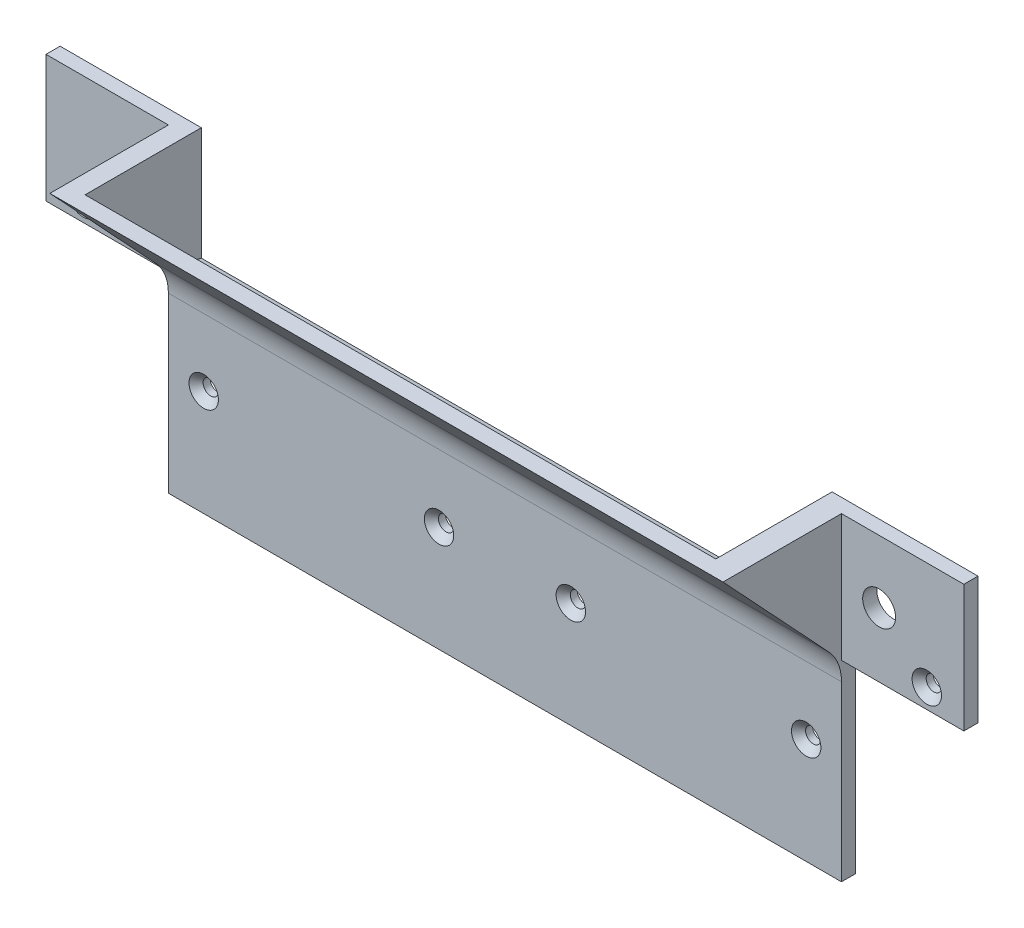
ISO-10303-21;
HEADER;
FILE_DESCRIPTION(('STEP AP214'),'2;1');
FILE_NAME('part.step','',(''),(''),'','','');
FILE_SCHEMA(('AUTOMOTIVE_DESIGN { 1 0 10303 214 1 1 1 1 }'));
ENDSEC;
DATA;
#1=APPLICATION_CONTEXT('core data for automotive mechanical design processes');
#2=APPLICATION_PROTOCOL_DEFINITION('international standard','automotive_design',2000,#1);
#3=PRODUCT_CONTEXT('',#1,'mechanical');
#4=PRODUCT('Part','Part','',(#3));
#5=PRODUCT_RELATED_PRODUCT_CATEGORY('part','',(#4));
#6=PRODUCT_DEFINITION_FORMATION('','',#4);
#7=PRODUCT_DEFINITION_CONTEXT('part definition',#1,'design');
#8=PRODUCT_DEFINITION('design','',#6,#7);
#9=PRODUCT_DEFINITION_SHAPE('','',#8);
#10=(LENGTH_UNIT() NAMED_UNIT(*) SI_UNIT(.MILLI.,.METRE.));
#11=(NAMED_UNIT(*) PLANE_ANGLE_UNIT() SI_UNIT($,.RADIAN.));
#12=(NAMED_UNIT(*) SI_UNIT($,.STERADIAN.) SOLID_ANGLE_UNIT());
#13=UNCERTAINTY_MEASURE_WITH_UNIT(LENGTH_MEASURE(1.E-05),#10,'distance_accuracy_value','');
#14=(GEOMETRIC_REPRESENTATION_CONTEXT(3) GLOBAL_UNCERTAINTY_ASSIGNED_CONTEXT((#13)) GLOBAL_UNIT_ASSIGNED_CONTEXT((#10,
#11,#12)) REPRESENTATION_CONTEXT('',''));
#15=CARTESIAN_POINT('',(0.,0.,0.));
#16=DIRECTION('',(0.,0.,1.));
#17=DIRECTION('',(1.,0.,0.));
#18=AXIS2_PLACEMENT_3D('',#15,#16,#17);
#19=CARTESIAN_POINT('',(0.,0.,3.));
#20=DIRECTION('',(0.,0.,-1.));
#21=DIRECTION('',(-1.,0.,0.));
#22=AXIS2_PLACEMENT_3D('',#19,#20,#21);
#23=PLANE('',#22);
#24=CARTESIAN_POINT('',(-89.62,-21.62,3.));
#25=DIRECTION('',(0.,0.,-1.));
#26=DIRECTION('',(-1.,0.,0.));
#27=AXIS2_PLACEMENT_3D('',#24,#25,#26);
#28=CIRCLE('',#27,3.12500000000002);
#29=CARTESIAN_POINT('',(-92.745,-21.62,3.));
#30=VERTEX_POINT('',#29);
#31=EDGE_CURVE('E253',#30,#30,#28,.T.);
#32=ORIENTED_EDGE('',*,*,#31,.T.);
#33=EDGE_LOOP('',(#32));
#34=FACE_BOUND('',#33,.T.);
#35=DIRECTION('',(0.,-1.,0.));
#36=VECTOR('',#35,1.);
#37=CARTESIAN_POINT('',(-71.5,-25.75,3.));
#38=LINE('',#37,#36);
#39=CARTESIAN_POINT('',(-71.5,1.25000000000001,3.));
#40=VERTEX_POINT('',#39);
#41=CARTESIAN_POINT('',(-71.5,-25.75,3.));
#42=VERTEX_POINT('',#41);
#43=EDGE_CURVE('E377',#40,#42,#38,.T.);
#44=ORIENTED_EDGE('',*,*,#43,.F.);
#45=DIRECTION('',(-1.,0.,0.));
#46=VECTOR('',#45,1.);
#47=CARTESIAN_POINT('',(-66.5,1.25,3.));
#48=LINE('',#47,#46);
#49=CARTESIAN_POINT('',(-97.5,1.24999999999999,3.));
#50=VERTEX_POINT('',#49);
#51=EDGE_CURVE('E366',#40,#50,#48,.T.);
#52=ORIENTED_EDGE('',*,*,#51,.T.);
#53=DIRECTION('',(0.,-1.,0.));
#54=VECTOR('',#53,1.);
#55=CARTESIAN_POINT('',(-97.5,-1.75,3.));
#56=LINE('',#55,#54);
#57=CARTESIAN_POINT('',(-97.5,-25.75,3.));
#58=VERTEX_POINT('',#57);
#59=EDGE_CURVE('E211',#50,#58,#56,.T.);
#60=ORIENTED_EDGE('',*,*,#59,.T.);
#61=DIRECTION('',(1.,0.,0.));
#62=VECTOR('',#61,1.);
#63=CARTESIAN_POINT('',(-97.5,-25.75,3.));
#64=LINE('',#63,#62);
#65=EDGE_CURVE('E208',#58,#42,#64,.T.);
#66=ORIENTED_EDGE('',*,*,#65,.T.);
#67=EDGE_LOOP('',(#44,#52,#60,#66));
#68=FACE_BOUND('',#67,.T.);
#69=CARTESIAN_POINT('',(-79.5,-12.1,3.));
#70=DIRECTION('',(0.,0.,1.));
#71=DIRECTION('',(1.,0.,0.));
#72=AXIS2_PLACEMENT_3D('',#69,#70,#71);
#73=CIRCLE('',#72,3.25000000000001);
#74=CARTESIAN_POINT('',(-76.25,-12.1,3.));
#75=VERTEX_POINT('',#74);
#76=EDGE_CURVE('E482',#75,#75,#73,.T.);
#77=ORIENTED_EDGE('',*,*,#76,.F.);
#78=EDGE_LOOP('',(#77));
#79=FACE_BOUND('',#78,.T.);
#80=ADVANCED_FACE('F40',(#34,#68,#79),#23,.F.);
#81=CARTESIAN_POINT('',(89.62,-21.62,3.));
#82=DIRECTION('',(0.,0.,-1.));
#83=DIRECTION('',(-1.,0.,0.));
#84=AXIS2_PLACEMENT_3D('',#81,#82,#83);
#85=CIRCLE('',#84,3.12500000000002);
#86=CARTESIAN_POINT('',(86.495,-21.62,3.));
#87=VERTEX_POINT('',#86);
#88=EDGE_CURVE('E259',#87,#87,#85,.T.);
#89=ORIENTED_EDGE('',*,*,#88,.T.);
#90=EDGE_LOOP('',(#89));
#91=FACE_BOUND('',#90,.T.);
#92=DIRECTION('',(0.,1.,0.));
#93=VECTOR('',#92,1.);
#94=CARTESIAN_POINT('',(71.5,1.25000000000003,3.));
#95=LINE('',#94,#93);
#96=CARTESIAN_POINT('',(71.4999999999999,-25.75,3.));
#97=VERTEX_POINT('',#96);
#98=CARTESIAN_POINT('',(71.5,1.25000000000002,3.));
#99=VERTEX_POINT('',#98);
#100=EDGE_CURVE('E385',#97,#99,#95,.T.);
#101=ORIENTED_EDGE('',*,*,#100,.F.);
#102=DIRECTION('',(1.,0.,0.));
#103=VECTOR('',#102,1.);
#104=CARTESIAN_POINT('',(97.5,-25.75,3.));
#105=LINE('',#104,#103);
#106=CARTESIAN_POINT('',(97.5,-25.75,3.));
#107=VERTEX_POINT('',#106);
#108=EDGE_CURVE('E216',#97,#107,#105,.T.);
#109=ORIENTED_EDGE('',*,*,#108,.T.);
#110=DIRECTION('',(0.,1.,0.));
#111=VECTOR('',#110,1.);
#112=CARTESIAN_POINT('',(97.5,-1.75,3.));
#113=LINE('',#112,#111);
#114=CARTESIAN_POINT('',(97.5,1.25000000000002,3.));
#115=VERTEX_POINT('',#114);
#116=EDGE_CURVE('E218',#107,#115,#113,.T.);
#117=ORIENTED_EDGE('',*,*,#116,.T.);
#118=DIRECTION('',(-1.,0.,0.));
#119=VECTOR('',#118,1.);
#120=CARTESIAN_POINT('',(66.5,1.25000000000002,3.));
#121=LINE('',#120,#119);
#122=EDGE_CURVE('E398',#115,#99,#121,.T.);
#123=ORIENTED_EDGE('',*,*,#122,.T.);
#124=EDGE_LOOP('',(#101,#109,#117,#123));
#125=FACE_BOUND('',#124,.T.);
#126=CARTESIAN_POINT('',(79.5,-12.1,3.));
#127=DIRECTION('',(0.,0.,1.));
#128=DIRECTION('',(1.,0.,0.));
#129=AXIS2_PLACEMENT_3D('',#126,#127,#128);
#130=CIRCLE('',#129,3.50000000000001);
#131=CARTESIAN_POINT('',(83.,-12.1,3.));
#132=VERTEX_POINT('',#131);
#133=EDGE_CURVE('E483',#132,#132,#130,.T.);
#134=ORIENTED_EDGE('',*,*,#133,.F.);
#135=EDGE_LOOP('',(#134));
#136=FACE_BOUND('',#135,.T.);
#137=ADVANCED_FACE('F302',(#91,#125,#136),#23,.F.);
#138=CARTESIAN_POINT('',(-64.,-44.,3.));
#139=DIRECTION('',(0.,0.,-1.));
#140=DIRECTION('',(-1.,0.,0.));
#141=AXIS2_PLACEMENT_3D('',#138,#139,#140);
#142=CIRCLE('',#141,3.12500000000002);
#143=CARTESIAN_POINT('',(-67.125,-44.,3.));
#144=VERTEX_POINT('',#143);
#145=EDGE_CURVE('E265',#144,#144,#142,.T.);
#146=ORIENTED_EDGE('',*,*,#145,.T.);
#147=EDGE_LOOP('',(#146));
#148=FACE_BOUND('',#147,.T.);
#149=CARTESIAN_POINT('',(-14.,-44.,3.));
#150=DIRECTION('',(0.,0.,-1.));
#151=DIRECTION('',(-1.,0.,0.));
#152=AXIS2_PLACEMENT_3D('',#149,#150,#151);
#153=CIRCLE('',#152,3.12500000000002);
#154=CARTESIAN_POINT('',(-17.125,-44.,3.));
#155=VERTEX_POINT('',#154);
#156=EDGE_CURVE('E268',#155,#155,#153,.T.);
#157=ORIENTED_EDGE('',*,*,#156,.T.);
#158=EDGE_LOOP('',(#157));
#159=FACE_BOUND('',#158,.T.);
#160=CARTESIAN_POINT('',(14.,-44.,3.));
#161=DIRECTION('',(0.,0.,-1.));
#162=DIRECTION('',(-1.,0.,0.));
#163=AXIS2_PLACEMENT_3D('',#160,#161,#162);
#164=CIRCLE('',#163,3.12500000000002);
#165=CARTESIAN_POINT('',(10.875,-44.,3.));
#166=VERTEX_POINT('',#165);
#167=EDGE_CURVE('E271',#166,#166,#164,.T.);
#168=ORIENTED_EDGE('',*,*,#167,.T.);
#169=EDGE_LOOP('',(#168));
#170=FACE_BOUND('',#169,.T.);
#171=CARTESIAN_POINT('',(64.,-44.,3.));
#172=DIRECTION('',(0.,0.,-1.));
#173=DIRECTION('',(-1.,0.,0.));
#174=AXIS2_PLACEMENT_3D('',#171,#172,#173);
#175=CIRCLE('',#174,3.12500000000002);
#176=CARTESIAN_POINT('',(60.875,-44.,3.));
#177=VERTEX_POINT('',#176);
#178=EDGE_CURVE('E274',#177,#177,#175,.T.);
#179=ORIENTED_EDGE('',*,*,#178,.T.);
#180=EDGE_LOOP('',(#179));
#181=FACE_BOUND('',#180,.T.);
#182=DIRECTION('',(0.,1.,0.));
#183=VECTOR('',#182,1.);
#184=CARTESIAN_POINT('',(71.5,-25.75,3.));
#185=LINE('',#184,#183);
#186=CARTESIAN_POINT('',(71.5,-66.5,3.));
#187=VERTEX_POINT('',#186);
#188=CARTESIAN_POINT('',(71.5,-29.6887920426456,3.));
#189=VERTEX_POINT('',#188);
#190=EDGE_CURVE('E62',#187,#189,#185,.T.);
#191=ORIENTED_EDGE('',*,*,#190,.T.);
#192=DIRECTION('',(1.,0.,0.));
#193=VECTOR('',#192,1.);
#194=CARTESIAN_POINT('',(0.,-29.6887920426456,3.));
#195=LINE('',#194,#193);
#196=CARTESIAN_POINT('',(-71.5,-29.6887920426455,3.));
#197=VERTEX_POINT('',#196);
#198=EDGE_CURVE('E181',#189,#197,#195,.F.);
#199=ORIENTED_EDGE('',*,*,#198,.T.);
#200=DIRECTION('',(0.,-1.,0.));
#201=VECTOR('',#200,1.);
#202=CARTESIAN_POINT('',(-71.5,-25.75,3.));
#203=LINE('',#202,#201);
#204=CARTESIAN_POINT('',(-71.5,-66.5,3.));
#205=VERTEX_POINT('',#204);
#206=EDGE_CURVE('E200',#197,#205,#203,.T.);
#207=ORIENTED_EDGE('',*,*,#206,.T.);
#208=DIRECTION('',(1.,0.,0.));
#209=VECTOR('',#208,1.);
#210=CARTESIAN_POINT('',(-71.5,-66.5,3.));
#211=LINE('',#210,#209);
#212=EDGE_CURVE('E207',#205,#187,#211,.T.);
#213=ORIENTED_EDGE('',*,*,#212,.T.);
#214=EDGE_LOOP('',(#191,#199,#207,#213));
#215=FACE_BOUND('',#214,.T.);
#216=ADVANCED_FACE('F199',(#148,#159,#170,#181,#215),#23,.F.);
#217=CARTESIAN_POINT('',(0.,0.,0.));
#218=DIRECTION('',(0.,0.,-1.));
#219=DIRECTION('',(-1.,0.,0.));
#220=AXIS2_PLACEMENT_3D('',#217,#218,#219);
#221=PLANE('',#220);
#222=DIRECTION('',(-1.,0.,0.));
#223=VECTOR('',#222,1.);
#224=CARTESIAN_POINT('',(-66.5,1.25,0.));
#225=LINE('',#224,#223);
#226=CARTESIAN_POINT('',(-67.5,1.25,0.));
#227=VERTEX_POINT('',#226);
#228=CARTESIAN_POINT('',(-97.5,1.24999999999999,0.));
#229=VERTEX_POINT('',#228);
#230=EDGE_CURVE('E394',#227,#229,#225,.T.);
#231=ORIENTED_EDGE('',*,*,#230,.F.);
#232=DIRECTION('',(0.,-1.,0.));
#233=VECTOR('',#232,1.);
#234=CARTESIAN_POINT('',(-67.5,-4.75,0.));
#235=LINE('',#234,#233);
#236=CARTESIAN_POINT('',(-67.5,-22.75,0.));
#237=VERTEX_POINT('',#236);
#238=EDGE_CURVE('E177',#227,#237,#235,.T.);
#239=ORIENTED_EDGE('',*,*,#238,.T.);
#240=DIRECTION('',(-1.,0.,0.));
#241=VECTOR('',#240,1.);
#242=CARTESIAN_POINT('',(66.5,-22.75,0.));
#243=LINE('',#242,#241);
#244=CARTESIAN_POINT('',(66.5,-22.75,0.));
#245=VERTEX_POINT('',#244);
#246=EDGE_CURVE('E350',#245,#237,#243,.T.);
#247=ORIENTED_EDGE('',*,*,#246,.F.);
#248=DIRECTION('',(0.,-1.,0.));
#249=VECTOR('',#248,1.);
#250=CARTESIAN_POINT('',(66.5,-4.75,0.));
#251=LINE('',#250,#249);
#252=CARTESIAN_POINT('',(66.5,1.25000000000002,0.));
#253=VERTEX_POINT('',#252);
#254=EDGE_CURVE('E408',#253,#245,#251,.T.);
#255=ORIENTED_EDGE('',*,*,#254,.F.);
#256=DIRECTION('',(-1.,0.,0.));
#257=VECTOR('',#256,1.);
#258=CARTESIAN_POINT('',(66.5,1.25000000000002,0.));
#259=LINE('',#258,#257);
#260=CARTESIAN_POINT('',(97.5,1.25000000000002,0.));
#261=VERTEX_POINT('',#260);
#262=EDGE_CURVE('E402',#261,#253,#259,.T.);
#263=ORIENTED_EDGE('',*,*,#262,.F.);
#264=DIRECTION('',(0.,1.,0.));
#265=VECTOR('',#264,1.);
#266=CARTESIAN_POINT('',(97.5,-1.75,0.));
#267=LINE('',#266,#265);
#268=CARTESIAN_POINT('',(97.5,-25.75,0.));
#269=VERTEX_POINT('',#268);
#270=EDGE_CURVE('E234',#269,#261,#267,.T.);
#271=ORIENTED_EDGE('',*,*,#270,.F.);
#272=DIRECTION('',(1.,0.,0.));
#273=VECTOR('',#272,1.);
#274=CARTESIAN_POINT('',(97.5,-25.75,0.));
#275=LINE('',#274,#273);
#276=CARTESIAN_POINT('',(71.5,-25.75,0.));
#277=VERTEX_POINT('',#276);
#278=EDGE_CURVE('E232',#277,#269,#275,.T.);
#279=ORIENTED_EDGE('',*,*,#278,.F.);
#280=DIRECTION('',(0.,1.,0.));
#281=VECTOR('',#280,1.);
#282=CARTESIAN_POINT('',(71.5,-25.75,0.));
#283=LINE('',#282,#281);
#284=CARTESIAN_POINT('',(71.5,-66.5,0.));
#285=VERTEX_POINT('',#284);
#286=EDGE_CURVE('E230',#285,#277,#283,.T.);
#287=ORIENTED_EDGE('',*,*,#286,.F.);
#288=DIRECTION('',(1.,0.,0.));
#289=VECTOR('',#288,1.);
#290=CARTESIAN_POINT('',(-71.5,-66.5,0.));
#291=LINE('',#290,#289);
#292=CARTESIAN_POINT('',(-71.5,-66.5,0.));
#293=VERTEX_POINT('',#292);
#294=EDGE_CURVE('E228',#293,#285,#291,.T.);
#295=ORIENTED_EDGE('',*,*,#294,.F.);
#296=DIRECTION('',(0.,-1.,0.));
#297=VECTOR('',#296,1.);
#298=CARTESIAN_POINT('',(-71.5,-25.75,0.));
#299=LINE('',#298,#297);
#300=CARTESIAN_POINT('',(-71.5,-25.75,0.));
#301=VERTEX_POINT('',#300);
#302=EDGE_CURVE('E226',#301,#293,#299,.T.);
#303=ORIENTED_EDGE('',*,*,#302,.F.);
#304=DIRECTION('',(1.,0.,0.));
#305=VECTOR('',#304,1.);
#306=CARTESIAN_POINT('',(-97.5,-25.75,0.));
#307=LINE('',#306,#305);
#308=CARTESIAN_POINT('',(-97.5,-25.75,0.));
#309=VERTEX_POINT('',#308);
#310=EDGE_CURVE('E223',#309,#301,#307,.T.);
#311=ORIENTED_EDGE('',*,*,#310,.F.);
#312=DIRECTION('',(0.,-1.,0.));
#313=VECTOR('',#312,1.);
#314=CARTESIAN_POINT('',(-97.5,-1.75,0.));
#315=LINE('',#314,#313);
#316=EDGE_CURVE('E221',#229,#309,#315,.T.);
#317=ORIENTED_EDGE('',*,*,#316,.F.);
#318=EDGE_LOOP('',(#231,#239,#247,#255,#263,#271,#279,#287,#295,#303,#311,#317));
#319=FACE_BOUND('',#318,.T.);
#320=CARTESIAN_POINT('',(64.,-44.,0.));
#321=DIRECTION('',(0.,0.,1.));
#322=DIRECTION('',(-1.,0.,0.));
#323=AXIS2_PLACEMENT_3D('',#320,#321,#322);
#324=CIRCLE('',#323,1.625);
#325=CARTESIAN_POINT('',(62.375,-44.,0.));
#326=VERTEX_POINT('',#325);
#327=EDGE_CURVE('E341',#326,#326,#324,.T.);
#328=ORIENTED_EDGE('',*,*,#327,.T.);
#329=EDGE_LOOP('',(#328));
#330=FACE_BOUND('',#329,.T.);
#331=CARTESIAN_POINT('',(-14.,-44.,0.));
#332=DIRECTION('',(0.,0.,1.));
#333=DIRECTION('',(1.,0.,0.));
#334=AXIS2_PLACEMENT_3D('',#331,#332,#333);
#335=CIRCLE('',#334,1.625);
#336=CARTESIAN_POINT('',(-12.375,-44.,0.));
#337=VERTEX_POINT('',#336);
#338=EDGE_CURVE('E347',#337,#337,#335,.T.);
#339=ORIENTED_EDGE('',*,*,#338,.T.);
#340=EDGE_LOOP('',(#339));
#341=FACE_BOUND('',#340,.T.);
#342=CARTESIAN_POINT('',(-89.62,-21.62,0.));
#343=DIRECTION('',(0.,0.,1.));
#344=DIRECTION('',(1.,0.,0.));
#345=AXIS2_PLACEMENT_3D('',#342,#343,#344);
#346=CIRCLE('',#345,1.625);
#347=CARTESIAN_POINT('',(-87.995,-21.62,0.));
#348=VERTEX_POINT('',#347);
#349=EDGE_CURVE('E224',#348,#348,#346,.T.);
#350=ORIENTED_EDGE('',*,*,#349,.T.);
#351=EDGE_LOOP('',(#350));
#352=FACE_BOUND('',#351,.T.);
#353=CARTESIAN_POINT('',(-64.,-44.,0.));
#354=DIRECTION('',(0.,0.,1.));
#355=DIRECTION('',(1.,0.,0.));
#356=AXIS2_PLACEMENT_3D('',#353,#354,#355);
#357=CIRCLE('',#356,1.625);
#358=CARTESIAN_POINT('',(-62.375,-44.,0.));
#359=VERTEX_POINT('',#358);
#360=EDGE_CURVE('E356',#359,#359,#357,.T.);
#361=ORIENTED_EDGE('',*,*,#360,.T.);
#362=EDGE_LOOP('',(#361));
#363=FACE_BOUND('',#362,.T.);
#364=CARTESIAN_POINT('',(14.,-44.,0.));
#365=DIRECTION('',(0.,0.,1.));
#366=DIRECTION('',(-1.,0.,0.));
#367=AXIS2_PLACEMENT_3D('',#364,#365,#366);
#368=CIRCLE('',#367,1.625);
#369=CARTESIAN_POINT('',(12.375,-44.,0.));
#370=VERTEX_POINT('',#369);
#371=EDGE_CURVE('E343',#370,#370,#368,.T.);
#372=ORIENTED_EDGE('',*,*,#371,.T.);
#373=EDGE_LOOP('',(#372));
#374=FACE_BOUND('',#373,.T.);
#375=CARTESIAN_POINT('',(89.62,-21.62,0.));
#376=DIRECTION('',(0.,0.,1.));
#377=DIRECTION('',(-1.,0.,0.));
#378=AXIS2_PLACEMENT_3D('',#375,#376,#377);
#379=CIRCLE('',#378,1.625);
#380=CARTESIAN_POINT('',(87.995,-21.62,0.));
#381=VERTEX_POINT('',#380);
#382=EDGE_CURVE('E344',#381,#381,#379,.T.);
#383=ORIENTED_EDGE('',*,*,#382,.T.);
#384=EDGE_LOOP('',(#383));
#385=FACE_BOUND('',#384,.T.);
#386=CARTESIAN_POINT('',(-79.5,-12.1,0.));
#387=DIRECTION('',(0.,0.,-1.));
#388=DIRECTION('',(-1.,0.,0.));
#389=AXIS2_PLACEMENT_3D('',#386,#387,#388);
#390=CIRCLE('',#389,3.25000000000001);
#391=CARTESIAN_POINT('',(-82.75,-12.1,0.));
#392=VERTEX_POINT('',#391);
#393=EDGE_CURVE('E174',#392,#392,#390,.F.);
#394=ORIENTED_EDGE('',*,*,#393,.T.);
#395=EDGE_LOOP('',(#394));
#396=FACE_BOUND('',#395,.T.);
#397=CARTESIAN_POINT('',(79.5,-12.1,0.));
#398=DIRECTION('',(0.,0.,-1.));
#399=DIRECTION('',(-1.,0.,0.));
#400=AXIS2_PLACEMENT_3D('',#397,#398,#399);
#401=CIRCLE('',#400,3.50000000000001);
#402=CARTESIAN_POINT('',(76.,-12.1,0.));
#403=VERTEX_POINT('',#402);
#404=EDGE_CURVE('E480',#403,#403,#401,.F.);
#405=ORIENTED_EDGE('',*,*,#404,.T.);
#406=EDGE_LOOP('',(#405));
#407=FACE_BOUND('',#406,.T.);
#408=ADVANCED_FACE('F313',(#319,#330,#341,#352,#363,#374,#385,#396,#407),#221,.T.);
#409=CARTESIAN_POINT('',(-97.5,-1.75,3.));
#410=DIRECTION('',(1.,0.,0.));
#411=DIRECTION('',(0.,0.,-1.));
#412=AXIS2_PLACEMENT_3D('',#409,#410,#411);
#413=PLANE('',#412);
#414=DIRECTION('',(0.,0.,-1.));
#415=VECTOR('',#414,1.);
#416=CARTESIAN_POINT('',(-97.5,-25.75,3.));
#417=LINE('',#416,#415);
#418=EDGE_CURVE('E247',#58,#309,#417,.T.);
#419=ORIENTED_EDGE('',*,*,#418,.F.);
#420=ORIENTED_EDGE('',*,*,#59,.F.);
#421=DIRECTION('',(0.,0.,1.));
#422=VECTOR('',#421,1.);
#423=CARTESIAN_POINT('',(-97.5,1.24999999999999,-31.7230596612879));
#424=LINE('',#423,#422);
#425=EDGE_CURVE('E396',#229,#50,#424,.T.);
#426=ORIENTED_EDGE('',*,*,#425,.F.);
#427=ORIENTED_EDGE('',*,*,#316,.T.);
#428=EDGE_LOOP('',(#419,#420,#426,#427));
#429=FACE_BOUND('',#428,.T.);
#430=ADVANCED_FACE('F318',(#429),#413,.F.);
#431=CARTESIAN_POINT('',(-97.5,-25.75,3.));
#432=DIRECTION('',(0.,1.,0.));
#433=DIRECTION('',(0.,0.,1.));
#434=AXIS2_PLACEMENT_3D('',#431,#432,#433);
#435=PLANE('',#434);
#436=ORIENTED_EDGE('',*,*,#310,.T.);
#437=DIRECTION('',(0.,0.,-1.));
#438=VECTOR('',#437,1.);
#439=CARTESIAN_POINT('',(-71.5,-25.75,3.));
#440=LINE('',#439,#438);
#441=EDGE_CURVE('E244',#42,#301,#440,.T.);
#442=ORIENTED_EDGE('',*,*,#441,.F.);
#443=ORIENTED_EDGE('',*,*,#65,.F.);
#444=ORIENTED_EDGE('',*,*,#418,.T.);
#445=EDGE_LOOP('',(#436,#442,#443,#444));
#446=FACE_BOUND('',#445,.T.);
#447=ADVANCED_FACE('F373',(#446),#435,.F.);
#448=CARTESIAN_POINT('',(-71.5,-25.75,3.));
#449=DIRECTION('',(1.,0.,0.));
#450=DIRECTION('',(0.,1.,0.));
#451=AXIS2_PLACEMENT_3D('',#448,#449,#450);
#452=PLANE('',#451);
#453=ORIENTED_EDGE('',*,*,#302,.T.);
#454=DIRECTION('',(0.,0.,-1.));
#455=VECTOR('',#454,1.);
#456=CARTESIAN_POINT('',(-71.5,-66.5,3.));
#457=LINE('',#456,#455);
#458=EDGE_CURVE('E205',#205,#293,#457,.T.);
#459=ORIENTED_EDGE('',*,*,#458,.F.);
#460=ORIENTED_EDGE('',*,*,#206,.F.);
#461=CARTESIAN_POINT('',(-71.5,-29.6887920426455,13.));
#462=DIRECTION('',(1.,0.,0.));
#463=DIRECTION('',(0.,1.,0.));
#464=AXIS2_PLACEMENT_3D('',#461,#462,#463);
#465=CIRCLE('',#464,10.);
#466=CARTESIAN_POINT('',(-71.5,-22.8692044240649,5.68609374461908));
#467=VERTEX_POINT('',#466);
#468=EDGE_CURVE('E11',#197,#467,#465,.T.);
#469=ORIENTED_EDGE('',*,*,#468,.T.);
#470=DIRECTION('',(0.,0.731390625538097,0.681958761858069));
#471=VECTOR('',#470,1.);
#472=CARTESIAN_POINT('',(-71.5,1.25000000000001,28.1751744242294));
#473=LINE('',#472,#471);
#474=CARTESIAN_POINT('',(-71.5,1.25000000000001,28.1751744242294));
#475=VERTEX_POINT('',#474);
#476=EDGE_CURVE('E55',#467,#475,#473,.T.);
#477=ORIENTED_EDGE('',*,*,#476,.T.);
#478=DIRECTION('',(0.,0.,-1.));
#479=VECTOR('',#478,1.);
#480=CARTESIAN_POINT('',(-71.5,1.25000000000001,3.));
#481=LINE('',#480,#479);
#482=EDGE_CURVE('E379',#475,#40,#481,.T.);
#483=ORIENTED_EDGE('',*,*,#482,.T.);
#484=ORIENTED_EDGE('',*,*,#43,.T.);
#485=ORIENTED_EDGE('',*,*,#441,.T.);
#486=EDGE_LOOP('',(#453,#459,#460,#469,#477,#483,#484,#485));
#487=FACE_BOUND('',#486,.T.);
#488=ADVANCED_FACE('F203',(#487),#452,.F.);
#489=CARTESIAN_POINT('',(-71.5,-66.5,3.));
#490=DIRECTION('',(0.,1.,0.));
#491=DIRECTION('',(0.,0.,1.));
#492=AXIS2_PLACEMENT_3D('',#489,#490,#491);
#493=PLANE('',#492);
#494=ORIENTED_EDGE('',*,*,#294,.T.);
#495=DIRECTION('',(0.,0.,-1.));
#496=VECTOR('',#495,1.);
#497=CARTESIAN_POINT('',(71.5,-66.5,3.));
#498=LINE('',#497,#496);
#499=EDGE_CURVE('E241',#187,#285,#498,.T.);
#500=ORIENTED_EDGE('',*,*,#499,.F.);
#501=ORIENTED_EDGE('',*,*,#212,.F.);
#502=ORIENTED_EDGE('',*,*,#458,.T.);
#503=EDGE_LOOP('',(#494,#500,#501,#502));
#504=FACE_BOUND('',#503,.T.);
#505=ADVANCED_FACE('F554',(#504),#493,.F.);
#506=CARTESIAN_POINT('',(97.5,-25.75,3.));
#507=DIRECTION('',(0.,1.,0.));
#508=DIRECTION('',(0.,0.,1.));
#509=AXIS2_PLACEMENT_3D('',#506,#507,#508);
#510=PLANE('',#509);
#511=ORIENTED_EDGE('',*,*,#278,.T.);
#512=DIRECTION('',(0.,0.,-1.));
#513=VECTOR('',#512,1.);
#514=CARTESIAN_POINT('',(97.5,-25.75,3.));
#515=LINE('',#514,#513);
#516=EDGE_CURVE('E220',#107,#269,#515,.T.);
#517=ORIENTED_EDGE('',*,*,#516,.F.);
#518=ORIENTED_EDGE('',*,*,#108,.F.);
#519=DIRECTION('',(0.,0.,-1.));
#520=VECTOR('',#519,1.);
#521=CARTESIAN_POINT('',(71.5,-25.75,3.));
#522=LINE('',#521,#520);
#523=EDGE_CURVE('E238',#97,#277,#522,.T.);
#524=ORIENTED_EDGE('',*,*,#523,.T.);
#525=EDGE_LOOP('',(#511,#517,#518,#524));
#526=FACE_BOUND('',#525,.T.);
#527=ADVANCED_FACE('F461',(#526),#510,.F.);
#528=CARTESIAN_POINT('',(97.5,-1.75,3.));
#529=DIRECTION('',(-1.,0.,0.));
#530=DIRECTION('',(0.,0.,1.));
#531=AXIS2_PLACEMENT_3D('',#528,#529,#530);
#532=PLANE('',#531);
#533=ORIENTED_EDGE('',*,*,#270,.T.);
#534=DIRECTION('',(0.,0.,1.));
#535=VECTOR('',#534,1.);
#536=CARTESIAN_POINT('',(97.5,1.25000000000002,-31.7230596612879));
#537=LINE('',#536,#535);
#538=EDGE_CURVE('E401',#261,#115,#537,.T.);
#539=ORIENTED_EDGE('',*,*,#538,.T.);
#540=ORIENTED_EDGE('',*,*,#116,.F.);
#541=ORIENTED_EDGE('',*,*,#516,.T.);
#542=EDGE_LOOP('',(#533,#539,#540,#541));
#543=FACE_BOUND('',#542,.T.);
#544=ADVANCED_FACE('F456',(#543),#532,.F.);
#545=CARTESIAN_POINT('',(-89.62,-21.62,3.));
#546=DIRECTION('',(0.,0.,-1.));
#547=DIRECTION('',(-1.,0.,0.));
#548=AXIS2_PLACEMENT_3D('',#545,#546,#547);
#549=CYLINDRICAL_SURFACE('',#548,1.625);
#550=CARTESIAN_POINT('',(-89.62,-21.62,1.50000000000001));
#551=DIRECTION('',(0.,0.,-1.));
#552=DIRECTION('',(-1.,0.,0.));
#553=AXIS2_PLACEMENT_3D('',#550,#551,#552);
#554=CIRCLE('',#553,1.625);
#555=CARTESIAN_POINT('',(-91.245,-21.62,1.50000000000001));
#556=VERTEX_POINT('',#555);
#557=EDGE_CURVE('E250',#556,#556,#554,.F.);
#558=ORIENTED_EDGE('',*,*,#557,.T.);
#559=EDGE_LOOP('',(#558));
#560=FACE_BOUND('',#559,.T.);
#561=ORIENTED_EDGE('',*,*,#349,.F.);
#562=EDGE_LOOP('',(#561));
#563=FACE_BOUND('',#562,.T.);
#564=ADVANCED_FACE('F453',(#560,#563),#549,.F.);
#565=CARTESIAN_POINT('',(-64.,-44.,3.));
#566=DIRECTION('',(0.,0.,-1.));
#567=DIRECTION('',(-1.,0.,0.));
#568=AXIS2_PLACEMENT_3D('',#565,#566,#567);
#569=CYLINDRICAL_SURFACE('',#568,1.625);
#570=CARTESIAN_POINT('',(-64.,-44.,1.50000000000001));
#571=DIRECTION('',(0.,0.,-1.));
#572=DIRECTION('',(-1.,0.,0.));
#573=AXIS2_PLACEMENT_3D('',#570,#571,#572);
#574=CIRCLE('',#573,1.625);
#575=CARTESIAN_POINT('',(-65.625,-44.,1.50000000000001));
#576=VERTEX_POINT('',#575);
#577=EDGE_CURVE('E179',#576,#576,#574,.F.);
#578=ORIENTED_EDGE('',*,*,#577,.T.);
#579=EDGE_LOOP('',(#578));
#580=FACE_BOUND('',#579,.T.);
#581=ORIENTED_EDGE('',*,*,#360,.F.);
#582=EDGE_LOOP('',(#581));
#583=FACE_BOUND('',#582,.T.);
#584=ADVANCED_FACE('F451',(#580,#583),#569,.F.);
#585=CARTESIAN_POINT('',(-14.,-44.,3.));
#586=DIRECTION('',(0.,0.,-1.));
#587=DIRECTION('',(-1.,0.,0.));
#588=AXIS2_PLACEMENT_3D('',#585,#586,#587);
#589=CYLINDRICAL_SURFACE('',#588,1.625);
#590=CARTESIAN_POINT('',(-14.,-44.,1.50000000000001));
#591=DIRECTION('',(0.,0.,-1.));
#592=DIRECTION('',(-1.,0.,0.));
#593=AXIS2_PLACEMENT_3D('',#590,#591,#592);
#594=CIRCLE('',#593,1.625);
#595=CARTESIAN_POINT('',(-15.625,-44.,1.50000000000001));
#596=VERTEX_POINT('',#595);
#597=EDGE_CURVE('E184',#596,#596,#594,.F.);
#598=ORIENTED_EDGE('',*,*,#597,.T.);
#599=EDGE_LOOP('',(#598));
#600=FACE_BOUND('',#599,.T.);
#601=ORIENTED_EDGE('',*,*,#338,.F.);
#602=EDGE_LOOP('',(#601));
#603=FACE_BOUND('',#602,.T.);
#604=ADVANCED_FACE('F282',(#600,#603),#589,.F.);
#605=CARTESIAN_POINT('',(14.,-44.,3.));
#606=DIRECTION('',(0.,0.,-1.));
#607=DIRECTION('',(-1.,0.,0.));
#608=AXIS2_PLACEMENT_3D('',#605,#606,#607);
#609=CYLINDRICAL_SURFACE('',#608,1.625);
#610=CARTESIAN_POINT('',(14.,-44.,1.50000000000001));
#611=DIRECTION('',(0.,0.,-1.));
#612=DIRECTION('',(-1.,0.,0.));
#613=AXIS2_PLACEMENT_3D('',#610,#611,#612);
#614=CIRCLE('',#613,1.625);
#615=CARTESIAN_POINT('',(12.375,-44.,1.50000000000001));
#616=VERTEX_POINT('',#615);
#617=EDGE_CURVE('E277',#616,#616,#614,.F.);
#618=ORIENTED_EDGE('',*,*,#617,.T.);
#619=EDGE_LOOP('',(#618));
#620=FACE_BOUND('',#619,.T.);
#621=ORIENTED_EDGE('',*,*,#371,.F.);
#622=EDGE_LOOP('',(#621));
#623=FACE_BOUND('',#622,.T.);
#624=ADVANCED_FACE('F337',(#620,#623),#609,.F.);
#625=CARTESIAN_POINT('',(64.,-44.,3.));
#626=DIRECTION('',(0.,0.,-1.));
#627=DIRECTION('',(-1.,0.,0.));
#628=AXIS2_PLACEMENT_3D('',#625,#626,#627);
#629=CYLINDRICAL_SURFACE('',#628,1.625);
#630=CARTESIAN_POINT('',(64.,-44.,1.50000000000001));
#631=DIRECTION('',(0.,0.,-1.));
#632=DIRECTION('',(-1.,0.,0.));
#633=AXIS2_PLACEMENT_3D('',#630,#631,#632);
#634=CIRCLE('',#633,1.625);
#635=CARTESIAN_POINT('',(62.375,-44.,1.50000000000001));
#636=VERTEX_POINT('',#635);
#637=EDGE_CURVE('E262',#636,#636,#634,.F.);
#638=ORIENTED_EDGE('',*,*,#637,.T.);
#639=EDGE_LOOP('',(#638));
#640=FACE_BOUND('',#639,.T.);
#641=ORIENTED_EDGE('',*,*,#327,.F.);
#642=EDGE_LOOP('',(#641));
#643=FACE_BOUND('',#642,.T.);
#644=ADVANCED_FACE('F333',(#640,#643),#629,.F.);
#645=CARTESIAN_POINT('',(89.62,-21.62,3.));
#646=DIRECTION('',(0.,0.,-1.));
#647=DIRECTION('',(-1.,0.,0.));
#648=AXIS2_PLACEMENT_3D('',#645,#646,#647);
#649=CYLINDRICAL_SURFACE('',#648,1.625);
#650=CARTESIAN_POINT('',(89.62,-21.62,1.50000000000001));
#651=DIRECTION('',(0.,0.,-1.));
#652=DIRECTION('',(-1.,0.,0.));
#653=AXIS2_PLACEMENT_3D('',#650,#651,#652);
#654=CIRCLE('',#653,1.625);
#655=CARTESIAN_POINT('',(87.995,-21.62,1.50000000000001));
#656=VERTEX_POINT('',#655);
#657=EDGE_CURVE('E256',#656,#656,#654,.F.);
#658=ORIENTED_EDGE('',*,*,#657,.T.);
#659=EDGE_LOOP('',(#658));
#660=FACE_BOUND('',#659,.T.);
#661=ORIENTED_EDGE('',*,*,#382,.F.);
#662=EDGE_LOOP('',(#661));
#663=FACE_BOUND('',#662,.T.);
#664=ADVANCED_FACE('F336',(#660,#663),#649,.F.);
#665=CARTESIAN_POINT('',(66.5,-22.75,0.));
#666=DIRECTION('',(0.,-0.971317231647455,0.237787374569645));
#667=DIRECTION('',(0.,-0.237787374569645,-0.971317231647455));
#668=AXIS2_PLACEMENT_3D('',#665,#666,#667);
#669=PLANE('',#668);
#670=DIRECTION('',(0.,0.237787374569645,0.971317231647455));
#671=VECTOR('',#670,1.);
#672=CARTESIAN_POINT('',(-67.5,-22.75,0.));
#673=LINE('',#672,#671);
#674=CARTESIAN_POINT('',(-67.5,-22.0155724613276,3.));
#675=VERTEX_POINT('',#674);
#676=EDGE_CURVE('E411',#237,#675,#673,.T.);
#677=ORIENTED_EDGE('',*,*,#676,.T.);
#678=DIRECTION('',(1.,0.,0.));
#679=VECTOR('',#678,1.);
#680=CARTESIAN_POINT('',(66.5,-22.0155724613276,3.));
#681=LINE('',#680,#679);
#682=CARTESIAN_POINT('',(66.5,-22.0155724613275,3.));
#683=VERTEX_POINT('',#682);
#684=EDGE_CURVE('E170',#675,#683,#681,.T.);
#685=ORIENTED_EDGE('',*,*,#684,.T.);
#686=DIRECTION('',(0.,0.237787374569645,0.971317231647455));
#687=VECTOR('',#686,1.);
#688=CARTESIAN_POINT('',(66.5,-22.75,0.));
#689=LINE('',#688,#687);
#690=EDGE_CURVE('E410',#245,#683,#689,.T.);
#691=ORIENTED_EDGE('',*,*,#690,.F.);
#692=ORIENTED_EDGE('',*,*,#246,.T.);
#693=EDGE_LOOP('',(#677,#685,#691,#692));
#694=FACE_BOUND('',#693,.T.);
#695=ADVANCED_FACE('F419',(#694),#669,.F.);
#696=CARTESIAN_POINT('',(66.5,0.,0.));
#697=DIRECTION('',(-1.,0.,0.));
#698=DIRECTION('',(0.,0.,1.));
#699=AXIS2_PLACEMENT_3D('',#696,#697,#698);
#700=PLANE('',#699);
#701=DIRECTION('',(0.,-0.731390625538098,-0.681958761858069));
#702=VECTOR('',#701,1.);
#703=CARTESIAN_POINT('',(66.5,-11.7350675491258,12.5856853456972));
#704=LINE('',#703,#702);
#705=CARTESIAN_POINT('',(66.5,1.25000000000009,24.6931423997582));
#706=VERTEX_POINT('',#705);
#707=EDGE_CURVE('E164',#706,#683,#704,.T.);
#708=ORIENTED_EDGE('',*,*,#707,.F.);
#709=DIRECTION('',(0.,0.,1.));
#710=VECTOR('',#709,1.);
#711=CARTESIAN_POINT('',(66.5,1.25000000000002,-31.7230596612879));
#712=LINE('',#711,#710);
#713=EDGE_CURVE('E161',#253,#706,#712,.T.);
#714=ORIENTED_EDGE('',*,*,#713,.F.);
#715=ORIENTED_EDGE('',*,*,#254,.T.);
#716=ORIENTED_EDGE('',*,*,#690,.T.);
#717=EDGE_LOOP('',(#708,#714,#715,#716));
#718=FACE_BOUND('',#717,.T.);
#719=ADVANCED_FACE('F434',(#718),#700,.T.);
#720=CARTESIAN_POINT('',(-67.5,0.,0.));
#721=DIRECTION('',(-1.,0.,0.));
#722=DIRECTION('',(0.,0.,1.));
#723=AXIS2_PLACEMENT_3D('',#720,#721,#722);
#724=PLANE('',#723);
#725=DIRECTION('',(0.,0.,1.));
#726=VECTOR('',#725,1.);
#727=CARTESIAN_POINT('',(-67.5,1.25,-31.7230596612879));
#728=LINE('',#727,#726);
#729=CARTESIAN_POINT('',(-67.5,1.25000000000001,24.6931423997582));
#730=VERTEX_POINT('',#729);
#731=EDGE_CURVE('E157',#227,#730,#728,.T.);
#732=ORIENTED_EDGE('',*,*,#731,.T.);
#733=DIRECTION('',(0.,-0.731390625538098,-0.681958761858069));
#734=VECTOR('',#733,1.);
#735=CARTESIAN_POINT('',(-67.5,-11.7350675491258,12.5856853456973));
#736=LINE('',#735,#734);
#737=EDGE_CURVE('E165',#730,#675,#736,.T.);
#738=ORIENTED_EDGE('',*,*,#737,.T.);
#739=ORIENTED_EDGE('',*,*,#676,.F.);
#740=ORIENTED_EDGE('',*,*,#238,.F.);
#741=EDGE_LOOP('',(#732,#738,#739,#740));
#742=FACE_BOUND('',#741,.T.);
#743=ADVANCED_FACE('F176',(#742),#724,.F.);
#744=CARTESIAN_POINT('',(-89.62,-21.62,1.50000000000001));
#745=DIRECTION('',(0.,0.,1.));
#746=DIRECTION('',(1.,0.,0.));
#747=AXIS2_PLACEMENT_3D('',#744,#745,#746);
#748=CONICAL_SURFACE('',#747,1.625,0.785398163397456);
#749=ORIENTED_EDGE('',*,*,#31,.F.);
#750=EDGE_LOOP('',(#749));
#751=FACE_BOUND('',#750,.T.);
#752=ORIENTED_EDGE('',*,*,#557,.F.);
#753=EDGE_LOOP('',(#752));
#754=FACE_BOUND('',#753,.T.);
#755=ADVANCED_FACE('F440',(#751,#754),#748,.F.);
#756=CARTESIAN_POINT('',(89.62,-21.62,1.50000000000001));
#757=DIRECTION('',(0.,0.,1.));
#758=DIRECTION('',(1.,0.,0.));
#759=AXIS2_PLACEMENT_3D('',#756,#757,#758);
#760=CONICAL_SURFACE('',#759,1.625,0.785398163397456);
#761=ORIENTED_EDGE('',*,*,#88,.F.);
#762=EDGE_LOOP('',(#761));
#763=FACE_BOUND('',#762,.T.);
#764=ORIENTED_EDGE('',*,*,#657,.F.);
#765=EDGE_LOOP('',(#764));
#766=FACE_BOUND('',#765,.T.);
#767=ADVANCED_FACE('F329',(#763,#766),#760,.F.);
#768=CARTESIAN_POINT('',(64.,-44.,1.50000000000001));
#769=DIRECTION('',(0.,0.,1.));
#770=DIRECTION('',(1.,0.,0.));
#771=AXIS2_PLACEMENT_3D('',#768,#769,#770);
#772=CONICAL_SURFACE('',#771,1.625,0.785398163397456);
#773=ORIENTED_EDGE('',*,*,#178,.F.);
#774=EDGE_LOOP('',(#773));
#775=FACE_BOUND('',#774,.T.);
#776=ORIENTED_EDGE('',*,*,#637,.F.);
#777=EDGE_LOOP('',(#776));
#778=FACE_BOUND('',#777,.T.);
#779=ADVANCED_FACE('F296',(#775,#778),#772,.F.);
#780=CARTESIAN_POINT('',(14.,-44.,1.50000000000001));
#781=DIRECTION('',(0.,0.,1.));
#782=DIRECTION('',(1.,0.,0.));
#783=AXIS2_PLACEMENT_3D('',#780,#781,#782);
#784=CONICAL_SURFACE('',#783,1.625,0.785398163397456);
#785=ORIENTED_EDGE('',*,*,#167,.F.);
#786=EDGE_LOOP('',(#785));
#787=FACE_BOUND('',#786,.T.);
#788=ORIENTED_EDGE('',*,*,#617,.F.);
#789=EDGE_LOOP('',(#788));
#790=FACE_BOUND('',#789,.T.);
#791=ADVANCED_FACE('F288',(#787,#790),#784,.F.);
#792=CARTESIAN_POINT('',(-14.,-44.,1.50000000000001));
#793=DIRECTION('',(0.,0.,1.));
#794=DIRECTION('',(1.,0.,0.));
#795=AXIS2_PLACEMENT_3D('',#792,#793,#794);
#796=CONICAL_SURFACE('',#795,1.625,0.785398163397456);
#797=ORIENTED_EDGE('',*,*,#156,.F.);
#798=EDGE_LOOP('',(#797));
#799=FACE_BOUND('',#798,.T.);
#800=ORIENTED_EDGE('',*,*,#597,.F.);
#801=EDGE_LOOP('',(#800));
#802=FACE_BOUND('',#801,.T.);
#803=ADVANCED_FACE('F285',(#799,#802),#796,.F.);
#804=CARTESIAN_POINT('',(-64.,-44.,1.50000000000001));
#805=DIRECTION('',(0.,0.,1.));
#806=DIRECTION('',(1.,0.,0.));
#807=AXIS2_PLACEMENT_3D('',#804,#805,#806);
#808=CONICAL_SURFACE('',#807,1.625,0.785398163397456);
#809=ORIENTED_EDGE('',*,*,#145,.F.);
#810=EDGE_LOOP('',(#809));
#811=FACE_BOUND('',#810,.T.);
#812=ORIENTED_EDGE('',*,*,#577,.F.);
#813=EDGE_LOOP('',(#812));
#814=FACE_BOUND('',#813,.T.);
#815=ADVANCED_FACE('F287',(#811,#814),#808,.F.);
#816=CARTESIAN_POINT('',(66.5,1.25000000000002,-31.7230596612879));
#817=DIRECTION('',(0.,1.,0.));
#818=DIRECTION('',(0.,0.,1.));
#819=AXIS2_PLACEMENT_3D('',#816,#817,#818);
#820=PLANE('',#819);
#821=ORIENTED_EDGE('',*,*,#713,.T.);
#822=DIRECTION('',(-1.,0.,0.));
#823=VECTOR('',#822,1.);
#824=CARTESIAN_POINT('',(108.415977669437,1.25000000000012,24.6931423997582));
#825=LINE('',#824,#823);
#826=EDGE_CURVE('E153',#706,#730,#825,.T.);
#827=ORIENTED_EDGE('',*,*,#826,.T.);
#828=ORIENTED_EDGE('',*,*,#731,.F.);
#829=ORIENTED_EDGE('',*,*,#230,.T.);
#830=ORIENTED_EDGE('',*,*,#425,.T.);
#831=ORIENTED_EDGE('',*,*,#51,.F.);
#832=ORIENTED_EDGE('',*,*,#482,.F.);
#833=DIRECTION('',(1.,0.,0.));
#834=VECTOR('',#833,1.);
#835=CARTESIAN_POINT('',(66.5,1.25000000000004,28.1751744242294));
#836=LINE('',#835,#834);
#837=CARTESIAN_POINT('',(71.5,1.25000000000003,28.1751744242294));
#838=VERTEX_POINT('',#837);
#839=EDGE_CURVE('E390',#475,#838,#836,.T.);
#840=ORIENTED_EDGE('',*,*,#839,.T.);
#841=DIRECTION('',(0.,0.,1.));
#842=VECTOR('',#841,1.);
#843=CARTESIAN_POINT('',(71.5,1.25000000000003,28.1751744242294));
#844=LINE('',#843,#842);
#845=EDGE_CURVE('E387',#99,#838,#844,.T.);
#846=ORIENTED_EDGE('',*,*,#845,.F.);
#847=ORIENTED_EDGE('',*,*,#122,.F.);
#848=ORIENTED_EDGE('',*,*,#538,.F.);
#849=ORIENTED_EDGE('',*,*,#262,.T.);
#850=EDGE_LOOP('',(#821,#827,#828,#829,#830,#831,#832,#840,#846,#847,#848,#849));
#851=FACE_BOUND('',#850,.T.);
#852=ADVANCED_FACE('F155',(#851),#820,.T.);
#853=CARTESIAN_POINT('',(66.5,-25.75,3.));
#854=DIRECTION('',(0.,-0.681958761858069,0.731390625538097));
#855=DIRECTION('',(0.,-0.731390625538097,-0.681958761858069));
#856=AXIS2_PLACEMENT_3D('',#853,#854,#855);
#857=PLANE('',#856);
#858=ORIENTED_EDGE('',*,*,#476,.F.);
#859=DIRECTION('',(1.,0.,0.));
#860=VECTOR('',#859,1.);
#861=CARTESIAN_POINT('',(66.5,-22.8692044240649,5.68609374461903));
#862=LINE('',#861,#860);
#863=CARTESIAN_POINT('',(71.5,-22.8692044240649,5.68609374461903));
#864=VERTEX_POINT('',#863);
#865=EDGE_CURVE('E178',#467,#864,#862,.T.);
#866=ORIENTED_EDGE('',*,*,#865,.T.);
#867=DIRECTION('',(0.,-0.731390625538097,-0.681958761858069));
#868=VECTOR('',#867,1.);
#869=CARTESIAN_POINT('',(71.5,-25.75,3.));
#870=LINE('',#869,#868);
#871=EDGE_CURVE('E194',#838,#864,#870,.T.);
#872=ORIENTED_EDGE('',*,*,#871,.F.);
#873=ORIENTED_EDGE('',*,*,#839,.F.);
#874=EDGE_LOOP('',(#858,#866,#872,#873));
#875=FACE_BOUND('',#874,.T.);
#876=ADVANCED_FACE('F423',(#875),#857,.T.);
#877=CARTESIAN_POINT('',(71.5,0.,0.));
#878=DIRECTION('',(1.,0.,0.));
#879=DIRECTION('',(0.,1.,0.));
#880=AXIS2_PLACEMENT_3D('',#877,#878,#879);
#881=PLANE('',#880);
#882=ORIENTED_EDGE('',*,*,#845,.T.);
#883=ORIENTED_EDGE('',*,*,#871,.T.);
#884=CARTESIAN_POINT('',(71.5,-29.6887920426456,13.));
#885=DIRECTION('',(1.,0.,0.));
#886=DIRECTION('',(0.,1.,0.));
#887=AXIS2_PLACEMENT_3D('',#884,#885,#886);
#888=CIRCLE('',#887,10.);
#889=EDGE_CURVE('E48',#864,#189,#888,.F.);
#890=ORIENTED_EDGE('',*,*,#889,.T.);
#891=ORIENTED_EDGE('',*,*,#190,.F.);
#892=ORIENTED_EDGE('',*,*,#499,.T.);
#893=ORIENTED_EDGE('',*,*,#286,.T.);
#894=ORIENTED_EDGE('',*,*,#523,.F.);
#895=ORIENTED_EDGE('',*,*,#100,.T.);
#896=EDGE_LOOP('',(#882,#883,#890,#891,#892,#893,#894,#895));
#897=FACE_BOUND('',#896,.T.);
#898=ADVANCED_FACE('F191',(#897),#881,.T.);
#899=CARTESIAN_POINT('',(108.415977669437,-11.7350675491257,12.5856853456973));
#900=DIRECTION('',(0.,0.681958761858069,-0.731390625538098));
#901=DIRECTION('',(0.,0.731390625538098,0.681958761858069));
#902=AXIS2_PLACEMENT_3D('',#899,#900,#901);
#903=PLANE('',#902);
#904=ORIENTED_EDGE('',*,*,#826,.F.);
#905=ORIENTED_EDGE('',*,*,#707,.T.);
#906=ORIENTED_EDGE('',*,*,#684,.F.);
#907=ORIENTED_EDGE('',*,*,#737,.F.);
#908=EDGE_LOOP('',(#904,#905,#906,#907));
#909=FACE_BOUND('',#908,.T.);
#910=ADVANCED_FACE('F168',(#909),#903,.T.);
#911=CARTESIAN_POINT('',(66.5,-29.6887920426456,13.));
#912=DIRECTION('',(1.,0.,0.));
#913=DIRECTION('',(0.,1.,0.));
#914=AXIS2_PLACEMENT_3D('',#911,#912,#913);
#915=CYLINDRICAL_SURFACE('',#914,10.);
#916=ORIENTED_EDGE('',*,*,#468,.F.);
#917=ORIENTED_EDGE('',*,*,#198,.F.);
#918=ORIENTED_EDGE('',*,*,#889,.F.);
#919=ORIENTED_EDGE('',*,*,#865,.F.);
#920=EDGE_LOOP('',(#916,#917,#918,#919));
#921=FACE_BOUND('',#920,.T.);
#922=ADVANCED_FACE('F42',(#921),#915,.F.);
#923=CARTESIAN_POINT('',(-79.5,-12.1,-14.142135623731));
#924=DIRECTION('',(0.,0.,1.));
#925=DIRECTION('',(1.,0.,0.));
#926=AXIS2_PLACEMENT_3D('',#923,#924,#925);
#927=CYLINDRICAL_SURFACE('',#926,3.25000000000001);
#928=ORIENTED_EDGE('',*,*,#76,.T.);
#929=EDGE_LOOP('',(#928));
#930=FACE_BOUND('',#929,.T.);
#931=ORIENTED_EDGE('',*,*,#393,.F.);
#932=EDGE_LOOP('',(#931));
#933=FACE_BOUND('',#932,.T.);
#934=ADVANCED_FACE('F495',(#930,#933),#927,.F.);
#935=CARTESIAN_POINT('',(79.5,-12.1,-14.142135623731));
#936=DIRECTION('',(0.,0.,1.));
#937=DIRECTION('',(1.,0.,0.));
#938=AXIS2_PLACEMENT_3D('',#935,#936,#937);
#939=CYLINDRICAL_SURFACE('',#938,3.50000000000001);
#940=ORIENTED_EDGE('',*,*,#133,.T.);
#941=EDGE_LOOP('',(#940));
#942=FACE_BOUND('',#941,.T.);
#943=ORIENTED_EDGE('',*,*,#404,.F.);
#944=EDGE_LOOP('',(#943));
#945=FACE_BOUND('',#944,.T.);
#946=ADVANCED_FACE('F492',(#942,#945),#939,.F.);
#947=CLOSED_SHELL('',(#80,#137,#216,#408,#430,#447,#488,#505,#527,#544,#564,#584,#604,#624,#644,
#664,#695,#719,#743,#755,#767,#779,#791,#803,#815,#852,#876,#898,#910,#922,#934,#946));
#948=MANIFOLD_SOLID_BREP('B2',#947);
#949=ADVANCED_BREP_SHAPE_REPRESENTATION('',(#18,#948),#14);
#950=SHAPE_DEFINITION_REPRESENTATION(#9,#949);
ENDSEC;
END-ISO-10303-21;
